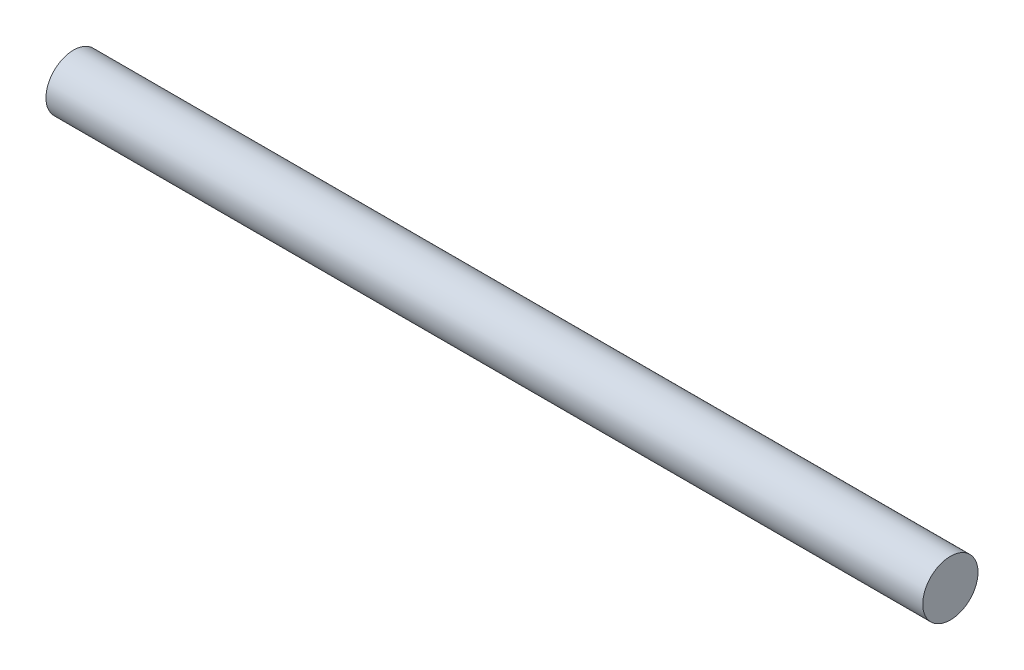
ISO-10303-21;
HEADER;
FILE_DESCRIPTION(('STEP AP214'),'2;1');
FILE_NAME('part.step','',(''),(''),'','','');
FILE_SCHEMA(('AUTOMOTIVE_DESIGN { 1 0 10303 214 1 1 1 1 }'));
ENDSEC;
DATA;
#1=APPLICATION_CONTEXT('core data for automotive mechanical design processes');
#2=APPLICATION_PROTOCOL_DEFINITION('international standard','automotive_design',2000,#1);
#3=PRODUCT_CONTEXT('',#1,'mechanical');
#4=PRODUCT('Part','Part','',(#3));
#5=PRODUCT_RELATED_PRODUCT_CATEGORY('part','',(#4));
#6=PRODUCT_DEFINITION_FORMATION('','',#4);
#7=PRODUCT_DEFINITION_CONTEXT('part definition',#1,'design');
#8=PRODUCT_DEFINITION('design','',#6,#7);
#9=PRODUCT_DEFINITION_SHAPE('','',#8);
#10=(LENGTH_UNIT() NAMED_UNIT(*) SI_UNIT(.MILLI.,.METRE.));
#11=(NAMED_UNIT(*) PLANE_ANGLE_UNIT() SI_UNIT($,.RADIAN.));
#12=(NAMED_UNIT(*) SI_UNIT($,.STERADIAN.) SOLID_ANGLE_UNIT());
#13=UNCERTAINTY_MEASURE_WITH_UNIT(LENGTH_MEASURE(1.E-05),#10,'distance_accuracy_value','');
#14=(GEOMETRIC_REPRESENTATION_CONTEXT(3) GLOBAL_UNCERTAINTY_ASSIGNED_CONTEXT((#13)) GLOBAL_UNIT_ASSIGNED_CONTEXT((#10,
#11,#12)) REPRESENTATION_CONTEXT('',''));
#15=CARTESIAN_POINT('',(0.,0.,0.));
#16=DIRECTION('',(0.,0.,1.));
#17=DIRECTION('',(1.,0.,0.));
#18=AXIS2_PLACEMENT_3D('',#15,#16,#17);
#19=CARTESIAN_POINT('',(25.,0.,0.));
#20=DIRECTION('',(-1.,0.,0.));
#21=DIRECTION('',(0.,0.,1.));
#22=AXIS2_PLACEMENT_3D('',#19,#20,#21);
#23=CYLINDRICAL_SURFACE('',#22,0.7875);
#24=CARTESIAN_POINT('',(25.,0.,0.));
#25=DIRECTION('',(1.,0.,0.));
#26=DIRECTION('',(0.,0.,-1.));
#27=AXIS2_PLACEMENT_3D('',#24,#25,#26);
#28=CIRCLE('',#27,0.7875);
#29=CARTESIAN_POINT('',(25.,0.,-0.7875));
#30=VERTEX_POINT('',#29);
#31=EDGE_CURVE('E10',#30,#30,#28,.T.);
#32=ORIENTED_EDGE('',*,*,#31,.F.);
#33=EDGE_LOOP('',(#32));
#34=FACE_BOUND('',#33,.T.);
#35=CARTESIAN_POINT('',(0.,0.,0.));
#36=DIRECTION('',(1.,0.,0.));
#37=DIRECTION('',(0.,0.,-1.));
#38=AXIS2_PLACEMENT_3D('',#35,#36,#37);
#39=CIRCLE('',#38,0.7875);
#40=CARTESIAN_POINT('',(0.,0.,-0.7875));
#41=VERTEX_POINT('',#40);
#42=EDGE_CURVE('E35',#41,#41,#39,.T.);
#43=ORIENTED_EDGE('',*,*,#42,.T.);
#44=EDGE_LOOP('',(#43));
#45=FACE_BOUND('',#44,.T.);
#46=ADVANCED_FACE('F32',(#34,#45),#23,.T.);
#47=CARTESIAN_POINT('',(25.,0.,0.));
#48=DIRECTION('',(1.,0.,0.));
#49=DIRECTION('',(0.,0.,-1.));
#50=AXIS2_PLACEMENT_3D('',#47,#48,#49);
#51=PLANE('',#50);
#52=ORIENTED_EDGE('',*,*,#31,.T.);
#53=EDGE_LOOP('',(#52));
#54=FACE_BOUND('',#53,.T.);
#55=ADVANCED_FACE('F47',(#54),#51,.T.);
#56=CARTESIAN_POINT('',(0.,0.,0.));
#57=DIRECTION('',(1.,0.,0.));
#58=DIRECTION('',(0.,0.,-1.));
#59=AXIS2_PLACEMENT_3D('',#56,#57,#58);
#60=PLANE('',#59);
#61=ORIENTED_EDGE('',*,*,#42,.F.);
#62=EDGE_LOOP('',(#61));
#63=FACE_BOUND('',#62,.T.);
#64=ADVANCED_FACE('F45',(#63),#60,.F.);
#65=CLOSED_SHELL('',(#46,#55,#64));
#66=MANIFOLD_SOLID_BREP('B2',#65);
#67=ADVANCED_BREP_SHAPE_REPRESENTATION('',(#18,#66),#14);
#68=SHAPE_DEFINITION_REPRESENTATION(#9,#67);
ENDSEC;
END-ISO-10303-21;
